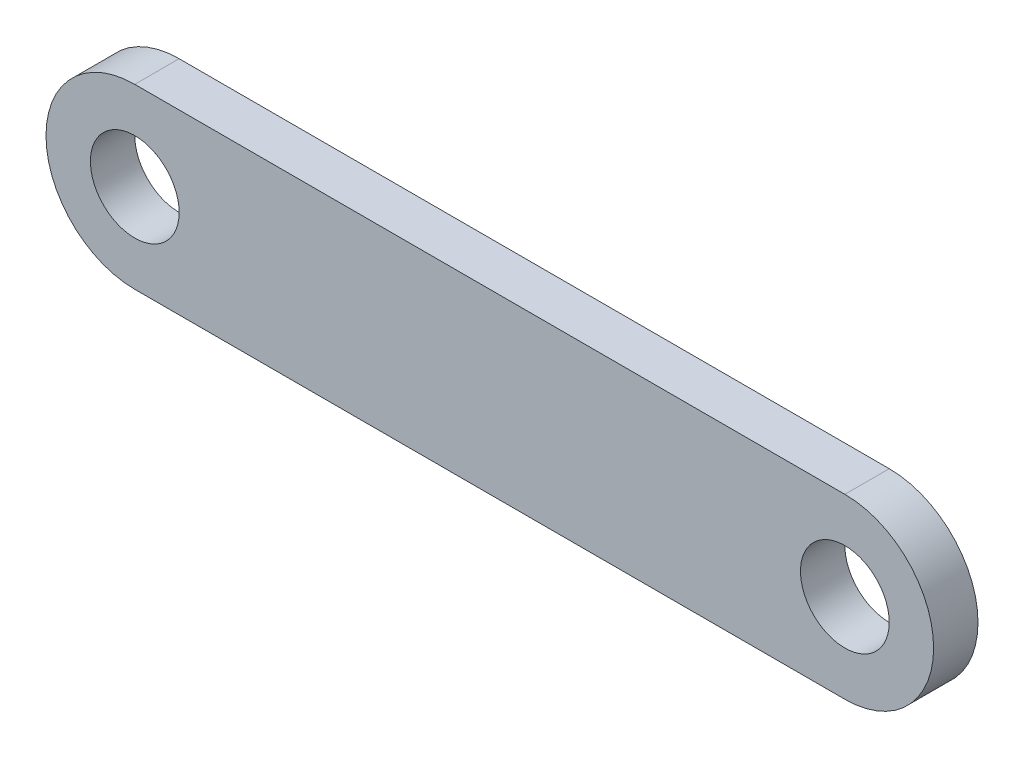
ISO-10303-21;
HEADER;
FILE_DESCRIPTION(('STEP AP214'),'2;1');
FILE_NAME('part.step','',(''),(''),'','','');
FILE_SCHEMA(('AUTOMOTIVE_DESIGN { 1 0 10303 214 1 1 1 1 }'));
ENDSEC;
DATA;
#1=APPLICATION_CONTEXT('core data for automotive mechanical design processes');
#2=APPLICATION_PROTOCOL_DEFINITION('international standard','automotive_design',2000,#1);
#3=PRODUCT_CONTEXT('',#1,'mechanical');
#4=PRODUCT('Part','Part','',(#3));
#5=PRODUCT_RELATED_PRODUCT_CATEGORY('part','',(#4));
#6=PRODUCT_DEFINITION_FORMATION('','',#4);
#7=PRODUCT_DEFINITION_CONTEXT('part definition',#1,'design');
#8=PRODUCT_DEFINITION('design','',#6,#7);
#9=PRODUCT_DEFINITION_SHAPE('','',#8);
#10=(LENGTH_UNIT() NAMED_UNIT(*) SI_UNIT(.MILLI.,.METRE.));
#11=(NAMED_UNIT(*) PLANE_ANGLE_UNIT() SI_UNIT($,.RADIAN.));
#12=(NAMED_UNIT(*) SI_UNIT($,.STERADIAN.) SOLID_ANGLE_UNIT());
#13=UNCERTAINTY_MEASURE_WITH_UNIT(LENGTH_MEASURE(1.E-05),#10,'distance_accuracy_value','');
#14=(GEOMETRIC_REPRESENTATION_CONTEXT(3) GLOBAL_UNCERTAINTY_ASSIGNED_CONTEXT((#13)) GLOBAL_UNIT_ASSIGNED_CONTEXT((#10,
#11,#12)) REPRESENTATION_CONTEXT('',''));
#15=CARTESIAN_POINT('',(0.,0.,0.));
#16=DIRECTION('',(0.,0.,1.));
#17=DIRECTION('',(1.,0.,0.));
#18=AXIS2_PLACEMENT_3D('',#15,#16,#17);
#19=CARTESIAN_POINT('',(0.,0.,1.));
#20=DIRECTION('',(0.,0.,1.));
#21=DIRECTION('',(1.,0.,0.));
#22=AXIS2_PLACEMENT_3D('',#19,#20,#21);
#23=PLANE('',#22);
#24=CARTESIAN_POINT('',(0.,0.,1.));
#25=DIRECTION('',(0.,0.,1.));
#26=DIRECTION('',(1.,0.,0.));
#27=AXIS2_PLACEMENT_3D('',#24,#25,#26);
#28=CIRCLE('',#27,2.);
#29=CARTESIAN_POINT('',(2.,0.,1.));
#30=VERTEX_POINT('',#29);
#31=EDGE_CURVE('E112',#30,#30,#28,.T.);
#32=ORIENTED_EDGE('',*,*,#31,.F.);
#33=EDGE_LOOP('',(#32));
#34=FACE_BOUND('',#33,.T.);
#35=CARTESIAN_POINT('',(0.,0.,1.));
#36=DIRECTION('',(0.,0.,1.));
#37=DIRECTION('',(1.,0.,0.));
#38=AXIS2_PLACEMENT_3D('',#35,#36,#37);
#39=CIRCLE('',#38,4.);
#40=CARTESIAN_POINT('',(0.,4.,1.));
#41=VERTEX_POINT('',#40);
#42=CARTESIAN_POINT('',(0.,-4.,1.));
#43=VERTEX_POINT('',#42);
#44=EDGE_CURVE('E92',#41,#43,#39,.T.);
#45=ORIENTED_EDGE('',*,*,#44,.T.);
#46=DIRECTION('',(1.,0.,0.));
#47=VECTOR('',#46,1.);
#48=CARTESIAN_POINT('',(0.,-4.,1.));
#49=LINE('',#48,#47);
#50=CARTESIAN_POINT('',(32.,-4.,1.));
#51=VERTEX_POINT('',#50);
#52=EDGE_CURVE('E87',#43,#51,#49,.T.);
#53=ORIENTED_EDGE('',*,*,#52,.T.);
#54=CARTESIAN_POINT('',(32.,0.,1.));
#55=DIRECTION('',(0.,0.,1.));
#56=DIRECTION('',(1.,0.,0.));
#57=AXIS2_PLACEMENT_3D('',#54,#55,#56);
#58=CIRCLE('',#57,4.);
#59=CARTESIAN_POINT('',(32.,4.,1.));
#60=VERTEX_POINT('',#59);
#61=EDGE_CURVE('E90',#51,#60,#58,.T.);
#62=ORIENTED_EDGE('',*,*,#61,.T.);
#63=DIRECTION('',(-1.,0.,0.));
#64=VECTOR('',#63,1.);
#65=CARTESIAN_POINT('',(0.,4.,1.));
#66=LINE('',#65,#64);
#67=EDGE_CURVE('E57',#60,#41,#66,.T.);
#68=ORIENTED_EDGE('',*,*,#67,.T.);
#69=EDGE_LOOP('',(#45,#53,#62,#68));
#70=FACE_BOUND('',#69,.T.);
#71=CARTESIAN_POINT('',(32.,0.,1.));
#72=DIRECTION('',(0.,0.,1.));
#73=DIRECTION('',(1.,0.,0.));
#74=AXIS2_PLACEMENT_3D('',#71,#72,#73);
#75=CIRCLE('',#74,2.);
#76=CARTESIAN_POINT('',(34.,0.,1.));
#77=VERTEX_POINT('',#76);
#78=EDGE_CURVE('E134',#77,#77,#75,.T.);
#79=ORIENTED_EDGE('',*,*,#78,.F.);
#80=EDGE_LOOP('',(#79));
#81=FACE_BOUND('',#80,.T.);
#82=ADVANCED_FACE('F39',(#34,#70,#81),#23,.T.);
#83=CARTESIAN_POINT('',(0.,0.,-1.));
#84=DIRECTION('',(0.,0.,1.));
#85=DIRECTION('',(1.,0.,0.));
#86=AXIS2_PLACEMENT_3D('',#83,#84,#85);
#87=PLANE('',#86);
#88=CARTESIAN_POINT('',(0.,0.,-1.));
#89=DIRECTION('',(0.,0.,1.));
#90=DIRECTION('',(1.,0.,0.));
#91=AXIS2_PLACEMENT_3D('',#88,#89,#90);
#92=CIRCLE('',#91,4.);
#93=CARTESIAN_POINT('',(0.,4.,-1.));
#94=VERTEX_POINT('',#93);
#95=CARTESIAN_POINT('',(0.,-4.,-1.));
#96=VERTEX_POINT('',#95);
#97=EDGE_CURVE('E108',#94,#96,#92,.T.);
#98=ORIENTED_EDGE('',*,*,#97,.F.);
#99=DIRECTION('',(-1.,0.,0.));
#100=VECTOR('',#99,1.);
#101=CARTESIAN_POINT('',(0.,4.,-1.));
#102=LINE('',#101,#100);
#103=CARTESIAN_POINT('',(32.,4.,-1.));
#104=VERTEX_POINT('',#103);
#105=EDGE_CURVE('E80',#104,#94,#102,.T.);
#106=ORIENTED_EDGE('',*,*,#105,.F.);
#107=CARTESIAN_POINT('',(32.,0.,-1.));
#108=DIRECTION('',(0.,0.,1.));
#109=DIRECTION('',(1.,0.,0.));
#110=AXIS2_PLACEMENT_3D('',#107,#108,#109);
#111=CIRCLE('',#110,4.);
#112=CARTESIAN_POINT('',(32.,-4.,-1.));
#113=VERTEX_POINT('',#112);
#114=EDGE_CURVE('E74',#113,#104,#111,.T.);
#115=ORIENTED_EDGE('',*,*,#114,.F.);
#116=DIRECTION('',(1.,0.,0.));
#117=VECTOR('',#116,1.);
#118=CARTESIAN_POINT('',(0.,-4.,-1.));
#119=LINE('',#118,#117);
#120=EDGE_CURVE('E97',#96,#113,#119,.T.);
#121=ORIENTED_EDGE('',*,*,#120,.F.);
#122=EDGE_LOOP('',(#98,#106,#115,#121));
#123=FACE_BOUND('',#122,.T.);
#124=CARTESIAN_POINT('',(0.,0.,-1.));
#125=DIRECTION('',(0.,0.,1.));
#126=DIRECTION('',(1.,0.,0.));
#127=AXIS2_PLACEMENT_3D('',#124,#125,#126);
#128=CIRCLE('',#127,2.);
#129=CARTESIAN_POINT('',(2.,0.,-1.));
#130=VERTEX_POINT('',#129);
#131=EDGE_CURVE('E130',#130,#130,#128,.T.);
#132=ORIENTED_EDGE('',*,*,#131,.T.);
#133=EDGE_LOOP('',(#132));
#134=FACE_BOUND('',#133,.T.);
#135=CARTESIAN_POINT('',(32.,0.,-1.));
#136=DIRECTION('',(0.,0.,1.));
#137=DIRECTION('',(1.,0.,0.));
#138=AXIS2_PLACEMENT_3D('',#135,#136,#137);
#139=CIRCLE('',#138,2.);
#140=CARTESIAN_POINT('',(34.,0.,-1.));
#141=VERTEX_POINT('',#140);
#142=EDGE_CURVE('E138',#141,#141,#139,.T.);
#143=ORIENTED_EDGE('',*,*,#142,.T.);
#144=EDGE_LOOP('',(#143));
#145=FACE_BOUND('',#144,.T.);
#146=ADVANCED_FACE('F125',(#123,#134,#145),#87,.F.);
#147=CARTESIAN_POINT('',(0.,0.,1.));
#148=DIRECTION('',(0.,0.,-1.));
#149=DIRECTION('',(-1.,0.,0.));
#150=AXIS2_PLACEMENT_3D('',#147,#148,#149);
#151=CYLINDRICAL_SURFACE('',#150,4.);
#152=ORIENTED_EDGE('',*,*,#97,.T.);
#153=DIRECTION('',(0.,0.,-1.));
#154=VECTOR('',#153,1.);
#155=CARTESIAN_POINT('',(0.,-4.,1.));
#156=LINE('',#155,#154);
#157=EDGE_CURVE('E11',#43,#96,#156,.T.);
#158=ORIENTED_EDGE('',*,*,#157,.F.);
#159=ORIENTED_EDGE('',*,*,#44,.F.);
#160=DIRECTION('',(0.,0.,-1.));
#161=VECTOR('',#160,1.);
#162=CARTESIAN_POINT('',(0.,4.,1.));
#163=LINE('',#162,#161);
#164=EDGE_CURVE('E104',#41,#94,#163,.T.);
#165=ORIENTED_EDGE('',*,*,#164,.T.);
#166=EDGE_LOOP('',(#152,#158,#159,#165));
#167=FACE_BOUND('',#166,.T.);
#168=ADVANCED_FACE('F41',(#167),#151,.T.);
#169=CARTESIAN_POINT('',(0.,-4.,1.));
#170=DIRECTION('',(0.,1.,0.));
#171=DIRECTION('',(0.,0.,1.));
#172=AXIS2_PLACEMENT_3D('',#169,#170,#171);
#173=PLANE('',#172);
#174=ORIENTED_EDGE('',*,*,#120,.T.);
#175=DIRECTION('',(0.,0.,-1.));
#176=VECTOR('',#175,1.);
#177=CARTESIAN_POINT('',(32.,-4.,1.));
#178=LINE('',#177,#176);
#179=EDGE_CURVE('E49',#51,#113,#178,.T.);
#180=ORIENTED_EDGE('',*,*,#179,.F.);
#181=ORIENTED_EDGE('',*,*,#52,.F.);
#182=ORIENTED_EDGE('',*,*,#157,.T.);
#183=EDGE_LOOP('',(#174,#180,#181,#182));
#184=FACE_BOUND('',#183,.T.);
#185=ADVANCED_FACE('F96',(#184),#173,.F.);
#186=CARTESIAN_POINT('',(32.,0.,1.));
#187=DIRECTION('',(0.,0.,-1.));
#188=DIRECTION('',(-1.,0.,0.));
#189=AXIS2_PLACEMENT_3D('',#186,#187,#188);
#190=CYLINDRICAL_SURFACE('',#189,4.);
#191=ORIENTED_EDGE('',*,*,#114,.T.);
#192=DIRECTION('',(0.,0.,-1.));
#193=VECTOR('',#192,1.);
#194=CARTESIAN_POINT('',(32.,4.,1.));
#195=LINE('',#194,#193);
#196=EDGE_CURVE('E99',#60,#104,#195,.T.);
#197=ORIENTED_EDGE('',*,*,#196,.F.);
#198=ORIENTED_EDGE('',*,*,#61,.F.);
#199=ORIENTED_EDGE('',*,*,#179,.T.);
#200=EDGE_LOOP('',(#191,#197,#198,#199));
#201=FACE_BOUND('',#200,.T.);
#202=ADVANCED_FACE('F100',(#201),#190,.T.);
#203=CARTESIAN_POINT('',(0.,4.,1.));
#204=DIRECTION('',(0.,-1.,0.));
#205=DIRECTION('',(0.,0.,-1.));
#206=AXIS2_PLACEMENT_3D('',#203,#204,#205);
#207=PLANE('',#206);
#208=ORIENTED_EDGE('',*,*,#105,.T.);
#209=ORIENTED_EDGE('',*,*,#164,.F.);
#210=ORIENTED_EDGE('',*,*,#67,.F.);
#211=ORIENTED_EDGE('',*,*,#196,.T.);
#212=EDGE_LOOP('',(#208,#209,#210,#211));
#213=FACE_BOUND('',#212,.T.);
#214=ADVANCED_FACE('F122',(#213),#207,.F.);
#215=CARTESIAN_POINT('',(0.,0.,1.));
#216=DIRECTION('',(0.,0.,-1.));
#217=DIRECTION('',(-1.,0.,0.));
#218=AXIS2_PLACEMENT_3D('',#215,#216,#217);
#219=CYLINDRICAL_SURFACE('',#218,2.);
#220=ORIENTED_EDGE('',*,*,#31,.T.);
#221=EDGE_LOOP('',(#220));
#222=FACE_BOUND('',#221,.T.);
#223=ORIENTED_EDGE('',*,*,#131,.F.);
#224=EDGE_LOOP('',(#223));
#225=FACE_BOUND('',#224,.T.);
#226=ADVANCED_FACE('F157',(#222,#225),#219,.F.);
#227=CARTESIAN_POINT('',(32.,0.,1.));
#228=DIRECTION('',(0.,0.,-1.));
#229=DIRECTION('',(-1.,0.,0.));
#230=AXIS2_PLACEMENT_3D('',#227,#228,#229);
#231=CYLINDRICAL_SURFACE('',#230,2.);
#232=ORIENTED_EDGE('',*,*,#78,.T.);
#233=EDGE_LOOP('',(#232));
#234=FACE_BOUND('',#233,.T.);
#235=ORIENTED_EDGE('',*,*,#142,.F.);
#236=EDGE_LOOP('',(#235));
#237=FACE_BOUND('',#236,.T.);
#238=ADVANCED_FACE('F146',(#234,#237),#231,.F.);
#239=CLOSED_SHELL('',(#82,#146,#168,#185,#202,#214,#226,#238));
#240=MANIFOLD_SOLID_BREP('B2',#239);
#241=ADVANCED_BREP_SHAPE_REPRESENTATION('',(#18,#240),#14);
#242=SHAPE_DEFINITION_REPRESENTATION(#9,#241);
ENDSEC;
END-ISO-10303-21;
